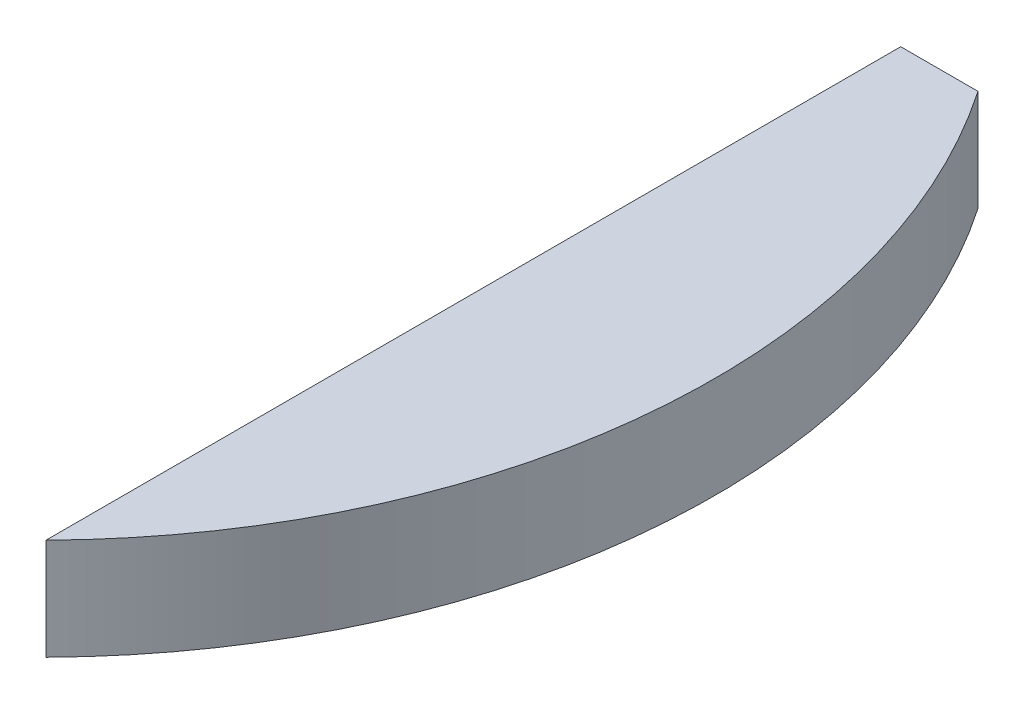
ISO-10303-21;
HEADER;
FILE_DESCRIPTION(('STEP AP214'),'2;1');
FILE_NAME('part.step','',(''),(''),'','','');
FILE_SCHEMA(('AUTOMOTIVE_DESIGN { 1 0 10303 214 1 1 1 1 }'));
ENDSEC;
DATA;
#1=APPLICATION_CONTEXT('core data for automotive mechanical design processes');
#2=APPLICATION_PROTOCOL_DEFINITION('international standard','automotive_design',2000,#1);
#3=PRODUCT_CONTEXT('',#1,'mechanical');
#4=PRODUCT('Part','Part','',(#3));
#5=PRODUCT_RELATED_PRODUCT_CATEGORY('part','',(#4));
#6=PRODUCT_DEFINITION_FORMATION('','',#4);
#7=PRODUCT_DEFINITION_CONTEXT('part definition',#1,'design');
#8=PRODUCT_DEFINITION('design','',#6,#7);
#9=PRODUCT_DEFINITION_SHAPE('','',#8);
#10=(LENGTH_UNIT() NAMED_UNIT(*) SI_UNIT(.MILLI.,.METRE.));
#11=(NAMED_UNIT(*) PLANE_ANGLE_UNIT() SI_UNIT($,.RADIAN.));
#12=(NAMED_UNIT(*) SI_UNIT($,.STERADIAN.) SOLID_ANGLE_UNIT());
#13=UNCERTAINTY_MEASURE_WITH_UNIT(LENGTH_MEASURE(1.E-05),#10,'distance_accuracy_value','');
#14=(GEOMETRIC_REPRESENTATION_CONTEXT(3) GLOBAL_UNCERTAINTY_ASSIGNED_CONTEXT((#13)) GLOBAL_UNIT_ASSIGNED_CONTEXT((#10,
#11,#12)) REPRESENTATION_CONTEXT('',''));
#15=CARTESIAN_POINT('',(0.,0.,0.));
#16=DIRECTION('',(0.,0.,1.));
#17=DIRECTION('',(1.,0.,0.));
#18=AXIS2_PLACEMENT_3D('',#15,#16,#17);
#19=CARTESIAN_POINT('',(0.,-23.,7.62499996274701));
#20=DIRECTION('',(0.,1.,0.));
#21=DIRECTION('',(0.,0.,1.));
#22=AXIS2_PLACEMENT_3D('',#19,#20,#21);
#23=PLANE('',#22);
#24=DIRECTION('',(-1.,0.,0.));
#25=VECTOR('',#24,1.);
#26=CARTESIAN_POINT('',(-12.2499999999998,-22.9999997619073,-11.2500000000002));
#27=LINE('',#26,#25);
#28=CARTESIAN_POINT('',(16.5359457842791,-22.9999997619164,-11.25));
#29=VERTEX_POINT('',#28);
#30=CARTESIAN_POINT('',(14.250000000006,-22.9999997619134,-11.25));
#31=VERTEX_POINT('',#30);
#32=EDGE_CURVE('E63',#29,#31,#27,.T.);
#33=ORIENTED_EDGE('',*,*,#32,.F.);
#34=CARTESIAN_POINT('',(1.16573417585641E-13,-22.9999997619255,0.));
#35=DIRECTION('',(0.,-1.,0.));
#36=DIRECTION('',(0.,0.,-1.));
#37=AXIS2_PLACEMENT_3D('',#34,#35,#36);
#38=CIRCLE('',#37,20.0000000745058);
#39=CARTESIAN_POINT('',(14.25,-22.9999997619255,14.0334423068694));
#40=VERTEX_POINT('',#39);
#41=EDGE_CURVE('E20',#40,#29,#38,.F.);
#42=ORIENTED_EDGE('',*,*,#41,.F.);
#43=DIRECTION('',(0.,0.,1.));
#44=VECTOR('',#43,1.);
#45=CARTESIAN_POINT('',(14.25,-22.9999997619255,12.));
#46=LINE('',#45,#44);
#47=EDGE_CURVE('E48',#40,#31,#46,.F.);
#48=ORIENTED_EDGE('',*,*,#47,.T.);
#49=EDGE_LOOP('',(#33,#42,#48));
#50=FACE_BOUND('',#49,.T.);
#51=ADVANCED_FACE('F17',(#50),#23,.F.);
#52=CARTESIAN_POINT('',(14.25,-33.4535583778433,12.));
#53=DIRECTION('',(1.,0.,0.));
#54=DIRECTION('',(0.,1.,0.));
#55=AXIS2_PLACEMENT_3D('',#52,#53,#54);
#56=PLANE('',#55);
#57=DIRECTION('',(0.,-1.,0.));
#58=VECTOR('',#57,1.);
#59=CARTESIAN_POINT('',(14.25,-20.,14.0334423068694));
#60=LINE('',#59,#58);
#61=CARTESIAN_POINT('',(14.25,-20.0000000000011,14.0334423068694));
#62=VERTEX_POINT('',#61);
#63=EDGE_CURVE('E60',#62,#40,#60,.T.);
#64=ORIENTED_EDGE('',*,*,#63,.F.);
#65=DIRECTION('',(0.,0.,1.));
#66=VECTOR('',#65,1.);
#67=CARTESIAN_POINT('',(14.25,-20.,7.62499996274701));
#68=LINE('',#67,#66);
#69=CARTESIAN_POINT('',(14.250000000003,-20.,-11.2500000000105));
#70=VERTEX_POINT('',#69);
#71=EDGE_CURVE('E54',#70,#62,#68,.T.);
#72=ORIENTED_EDGE('',*,*,#71,.F.);
#73=DIRECTION('',(0.,1.,0.));
#74=VECTOR('',#73,1.);
#75=CARTESIAN_POINT('',(14.250000000009,-23.,-11.2500000000001));
#76=LINE('',#75,#74);
#77=EDGE_CURVE('E57',#31,#70,#76,.T.);
#78=ORIENTED_EDGE('',*,*,#77,.F.);
#79=ORIENTED_EDGE('',*,*,#47,.F.);
#80=EDGE_LOOP('',(#64,#72,#78,#79));
#81=FACE_BOUND('',#80,.T.);
#82=ADVANCED_FACE('F56',(#81),#56,.F.);
#83=CARTESIAN_POINT('',(1.16573417585641E-13,-20.,0.));
#84=DIRECTION('',(0.,-1.,0.));
#85=DIRECTION('',(0.,0.,-1.));
#86=AXIS2_PLACEMENT_3D('',#83,#84,#85);
#87=CYLINDRICAL_SURFACE('',#86,20.0000000745058);
#88=CARTESIAN_POINT('',(1.16573417585641E-13,-20.0000000000021,0.));
#89=DIRECTION('',(0.,-1.,0.));
#90=DIRECTION('',(0.,0.,-1.));
#91=AXIS2_PLACEMENT_3D('',#88,#89,#90);
#92=CIRCLE('',#91,20.0000000745058);
#93=CARTESIAN_POINT('',(16.5359457842738,-20.0000000000021,-11.2500000000079));
#94=VERTEX_POINT('',#93);
#95=EDGE_CURVE('E26',#62,#94,#92,.F.);
#96=ORIENTED_EDGE('',*,*,#95,.F.);
#97=ORIENTED_EDGE('',*,*,#63,.T.);
#98=ORIENTED_EDGE('',*,*,#41,.T.);
#99=DIRECTION('',(0.,1.,0.));
#100=VECTOR('',#99,1.);
#101=CARTESIAN_POINT('',(16.5359457842907,-23.,-11.25));
#102=LINE('',#101,#100);
#103=EDGE_CURVE('E35',#94,#29,#102,.F.);
#104=ORIENTED_EDGE('',*,*,#103,.F.);
#105=EDGE_LOOP('',(#96,#97,#98,#104));
#106=FACE_BOUND('',#105,.T.);
#107=ADVANCED_FACE('F83',(#106),#87,.T.);
#108=CARTESIAN_POINT('',(-12.2499999999998,-23.,-11.2500000000002));
#109=DIRECTION('',(0.,0.,-1.));
#110=DIRECTION('',(-1.,0.,0.));
#111=AXIS2_PLACEMENT_3D('',#108,#109,#110);
#112=PLANE('',#111);
#113=ORIENTED_EDGE('',*,*,#103,.T.);
#114=ORIENTED_EDGE('',*,*,#32,.T.);
#115=ORIENTED_EDGE('',*,*,#77,.T.);
#116=DIRECTION('',(1.,0.,0.));
#117=VECTOR('',#116,1.);
#118=CARTESIAN_POINT('',(0.,-20.,-11.2500000000158));
#119=LINE('',#118,#117);
#120=EDGE_CURVE('E11',#94,#70,#119,.F.);
#121=ORIENTED_EDGE('',*,*,#120,.F.);
#122=EDGE_LOOP('',(#113,#114,#115,#121));
#123=FACE_BOUND('',#122,.T.);
#124=ADVANCED_FACE('F66',(#123),#112,.T.);
#125=CARTESIAN_POINT('',(0.,-20.,7.62499996274701));
#126=DIRECTION('',(0.,1.,0.));
#127=DIRECTION('',(0.,0.,1.));
#128=AXIS2_PLACEMENT_3D('',#125,#126,#127);
#129=PLANE('',#128);
#130=ORIENTED_EDGE('',*,*,#95,.T.);
#131=ORIENTED_EDGE('',*,*,#120,.T.);
#132=ORIENTED_EDGE('',*,*,#71,.T.);
#133=EDGE_LOOP('',(#130,#131,#132));
#134=FACE_BOUND('',#133,.T.);
#135=ADVANCED_FACE('F68',(#134),#129,.T.);
#136=CLOSED_SHELL('',(#51,#82,#107,#124,#135));
#137=MANIFOLD_SOLID_BREP('B1',#136);
#138=ADVANCED_BREP_SHAPE_REPRESENTATION('',(#18,#137),#14);
#139=SHAPE_DEFINITION_REPRESENTATION(#9,#138);
ENDSEC;
END-ISO-10303-21;
